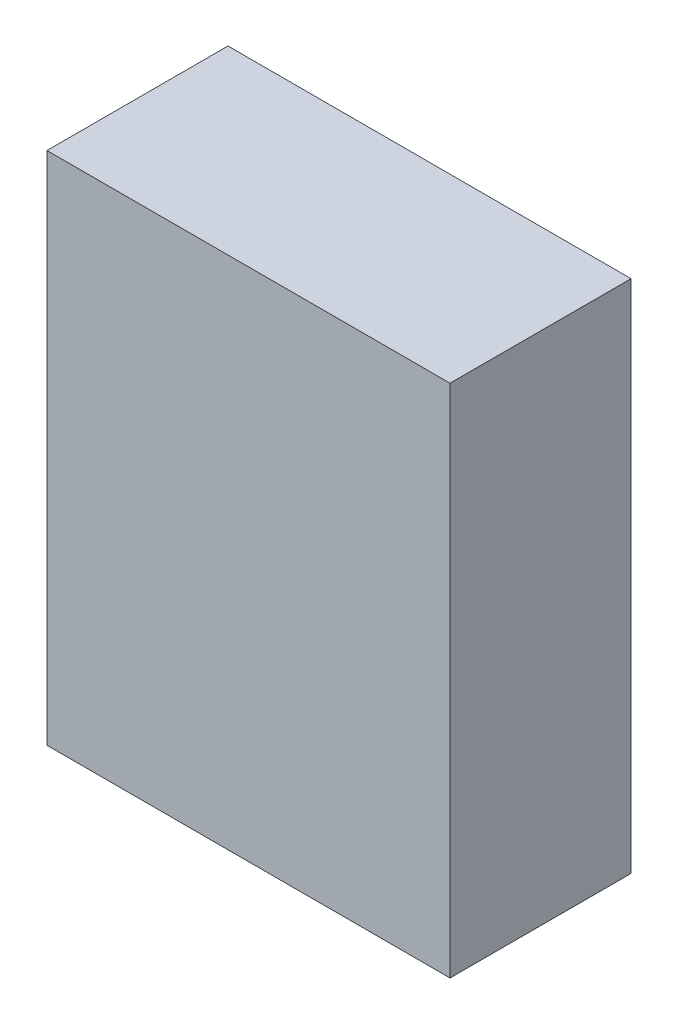
ISO-10303-21;
HEADER;
FILE_DESCRIPTION(('STEP AP214'),'2;1');
FILE_NAME('part.step','',(''),(''),'','','');
FILE_SCHEMA(('AUTOMOTIVE_DESIGN { 1 0 10303 214 1 1 1 1 }'));
ENDSEC;
DATA;
#1=APPLICATION_CONTEXT('core data for automotive mechanical design processes');
#2=APPLICATION_PROTOCOL_DEFINITION('international standard','automotive_design',2000,#1);
#3=PRODUCT_CONTEXT('',#1,'mechanical');
#4=PRODUCT('Part','Part','',(#3));
#5=PRODUCT_RELATED_PRODUCT_CATEGORY('part','',(#4));
#6=PRODUCT_DEFINITION_FORMATION('','',#4);
#7=PRODUCT_DEFINITION_CONTEXT('part definition',#1,'design');
#8=PRODUCT_DEFINITION('design','',#6,#7);
#9=PRODUCT_DEFINITION_SHAPE('','',#8);
#10=(LENGTH_UNIT() NAMED_UNIT(*) SI_UNIT(.MILLI.,.METRE.));
#11=(NAMED_UNIT(*) PLANE_ANGLE_UNIT() SI_UNIT($,.RADIAN.));
#12=(NAMED_UNIT(*) SI_UNIT($,.STERADIAN.) SOLID_ANGLE_UNIT());
#13=UNCERTAINTY_MEASURE_WITH_UNIT(LENGTH_MEASURE(1.E-05),#10,'distance_accuracy_value','');
#14=(GEOMETRIC_REPRESENTATION_CONTEXT(3) GLOBAL_UNCERTAINTY_ASSIGNED_CONTEXT((#13)) GLOBAL_UNIT_ASSIGNED_CONTEXT((#10,
#11,#12)) REPRESENTATION_CONTEXT('',''));
#15=CARTESIAN_POINT('',(0.,0.,0.));
#16=DIRECTION('',(0.,0.,1.));
#17=DIRECTION('',(1.,0.,0.));
#18=AXIS2_PLACEMENT_3D('',#15,#16,#17);
#19=CARTESIAN_POINT('',(28.956,37.0078,13.0048));
#20=DIRECTION('',(1.,0.,0.));
#21=DIRECTION('',(0.,1.,0.));
#22=AXIS2_PLACEMENT_3D('',#19,#20,#21);
#23=PLANE('',#22);
#24=DIRECTION('',(0.,-1.,0.));
#25=VECTOR('',#24,1.);
#26=CARTESIAN_POINT('',(28.956,37.0078,0.));
#27=LINE('',#26,#25);
#28=CARTESIAN_POINT('',(28.956,37.0078,0.));
#29=VERTEX_POINT('',#28);
#30=CARTESIAN_POINT('',(28.956,0.,0.));
#31=VERTEX_POINT('',#30);
#32=EDGE_CURVE('E67',#29,#31,#27,.T.);
#33=ORIENTED_EDGE('',*,*,#32,.F.);
#34=DIRECTION('',(0.,0.,-1.));
#35=VECTOR('',#34,1.);
#36=CARTESIAN_POINT('',(28.956,37.0078,13.0048));
#37=LINE('',#36,#35);
#38=CARTESIAN_POINT('',(28.956,37.0078,13.0048));
#39=VERTEX_POINT('',#38);
#40=EDGE_CURVE('E19',#39,#29,#37,.T.);
#41=ORIENTED_EDGE('',*,*,#40,.F.);
#42=DIRECTION('',(0.,-1.,0.));
#43=VECTOR('',#42,1.);
#44=CARTESIAN_POINT('',(28.956,37.0078,13.0048));
#45=LINE('',#44,#43);
#46=CARTESIAN_POINT('',(28.956,0.,13.0048));
#47=VERTEX_POINT('',#46);
#48=EDGE_CURVE('E69',#39,#47,#45,.T.);
#49=ORIENTED_EDGE('',*,*,#48,.T.);
#50=DIRECTION('',(0.,0.,-1.));
#51=VECTOR('',#50,1.);
#52=CARTESIAN_POINT('',(28.956,0.,13.0048));
#53=LINE('',#52,#51);
#54=EDGE_CURVE('E11',#47,#31,#53,.T.);
#55=ORIENTED_EDGE('',*,*,#54,.T.);
#56=EDGE_LOOP('',(#33,#41,#49,#55));
#57=FACE_BOUND('',#56,.T.);
#58=ADVANCED_FACE('F16',(#57),#23,.T.);
#59=CARTESIAN_POINT('',(28.956,0.,13.0048));
#60=DIRECTION('',(0.,-1.,0.));
#61=DIRECTION('',(0.,0.,-1.));
#62=AXIS2_PLACEMENT_3D('',#59,#60,#61);
#63=PLANE('',#62);
#64=DIRECTION('',(-1.,0.,0.));
#65=VECTOR('',#64,1.);
#66=CARTESIAN_POINT('',(28.956,0.,0.));
#67=LINE('',#66,#65);
#68=CARTESIAN_POINT('',(0.,0.,0.));
#69=VERTEX_POINT('',#68);
#70=EDGE_CURVE('E72',#31,#69,#67,.T.);
#71=ORIENTED_EDGE('',*,*,#70,.F.);
#72=ORIENTED_EDGE('',*,*,#54,.F.);
#73=DIRECTION('',(-1.,0.,0.));
#74=VECTOR('',#73,1.);
#75=CARTESIAN_POINT('',(28.956,0.,13.0048));
#76=LINE('',#75,#74);
#77=CARTESIAN_POINT('',(0.,0.,13.0048));
#78=VERTEX_POINT('',#77);
#79=EDGE_CURVE('E78',#47,#78,#76,.T.);
#80=ORIENTED_EDGE('',*,*,#79,.T.);
#81=DIRECTION('',(0.,0.,-1.));
#82=VECTOR('',#81,1.);
#83=CARTESIAN_POINT('',(0.,0.,13.0048));
#84=LINE('',#83,#82);
#85=EDGE_CURVE('E24',#78,#69,#84,.T.);
#86=ORIENTED_EDGE('',*,*,#85,.T.);
#87=EDGE_LOOP('',(#71,#72,#80,#86));
#88=FACE_BOUND('',#87,.T.);
#89=ADVANCED_FACE('F85',(#88),#63,.T.);
#90=CARTESIAN_POINT('',(0.,0.,13.0048));
#91=DIRECTION('',(-1.,0.,0.));
#92=DIRECTION('',(0.,-1.,0.));
#93=AXIS2_PLACEMENT_3D('',#90,#91,#92);
#94=PLANE('',#93);
#95=DIRECTION('',(0.,1.,0.));
#96=VECTOR('',#95,1.);
#97=CARTESIAN_POINT('',(0.,0.,0.));
#98=LINE('',#97,#96);
#99=CARTESIAN_POINT('',(0.,37.0078,0.));
#100=VERTEX_POINT('',#99);
#101=EDGE_CURVE('E68',#69,#100,#98,.T.);
#102=ORIENTED_EDGE('',*,*,#101,.F.);
#103=ORIENTED_EDGE('',*,*,#85,.F.);
#104=DIRECTION('',(0.,1.,0.));
#105=VECTOR('',#104,1.);
#106=CARTESIAN_POINT('',(0.,0.,13.0048));
#107=LINE('',#106,#105);
#108=CARTESIAN_POINT('',(0.,37.0078,13.0048));
#109=VERTEX_POINT('',#108);
#110=EDGE_CURVE('E80',#78,#109,#107,.T.);
#111=ORIENTED_EDGE('',*,*,#110,.T.);
#112=DIRECTION('',(0.,0.,-1.));
#113=VECTOR('',#112,1.);
#114=CARTESIAN_POINT('',(0.,37.0078,13.0048));
#115=LINE('',#114,#113);
#116=EDGE_CURVE('E31',#109,#100,#115,.T.);
#117=ORIENTED_EDGE('',*,*,#116,.T.);
#118=EDGE_LOOP('',(#102,#103,#111,#117));
#119=FACE_BOUND('',#118,.T.);
#120=ADVANCED_FACE('F88',(#119),#94,.T.);
#121=CARTESIAN_POINT('',(0.,37.0078,13.0048));
#122=DIRECTION('',(0.,1.,0.));
#123=DIRECTION('',(0.,0.,1.));
#124=AXIS2_PLACEMENT_3D('',#121,#122,#123);
#125=PLANE('',#124);
#126=DIRECTION('',(1.,0.,0.));
#127=VECTOR('',#126,1.);
#128=CARTESIAN_POINT('',(0.,37.0078,0.));
#129=LINE('',#128,#127);
#130=EDGE_CURVE('E55',#100,#29,#129,.T.);
#131=ORIENTED_EDGE('',*,*,#130,.F.);
#132=ORIENTED_EDGE('',*,*,#116,.F.);
#133=DIRECTION('',(1.,0.,0.));
#134=VECTOR('',#133,1.);
#135=CARTESIAN_POINT('',(0.,37.0078,13.0048));
#136=LINE('',#135,#134);
#137=EDGE_CURVE('E58',#109,#39,#136,.T.);
#138=ORIENTED_EDGE('',*,*,#137,.T.);
#139=ORIENTED_EDGE('',*,*,#40,.T.);
#140=EDGE_LOOP('',(#131,#132,#138,#139));
#141=FACE_BOUND('',#140,.T.);
#142=ADVANCED_FACE('F54',(#141),#125,.T.);
#143=CARTESIAN_POINT('',(28.956,0.,13.0048));
#144=DIRECTION('',(0.,0.,-1.));
#145=DIRECTION('',(-1.,0.,0.));
#146=AXIS2_PLACEMENT_3D('',#143,#144,#145);
#147=PLANE('',#146);
#148=ORIENTED_EDGE('',*,*,#48,.F.);
#149=ORIENTED_EDGE('',*,*,#137,.F.);
#150=ORIENTED_EDGE('',*,*,#110,.F.);
#151=ORIENTED_EDGE('',*,*,#79,.F.);
#152=EDGE_LOOP('',(#148,#149,#150,#151));
#153=FACE_BOUND('',#152,.T.);
#154=ADVANCED_FACE('F90',(#153),#147,.F.);
#155=CARTESIAN_POINT('',(28.956,0.,0.));
#156=DIRECTION('',(0.,0.,-1.));
#157=DIRECTION('',(-1.,0.,0.));
#158=AXIS2_PLACEMENT_3D('',#155,#156,#157);
#159=PLANE('',#158);
#160=ORIENTED_EDGE('',*,*,#32,.T.);
#161=ORIENTED_EDGE('',*,*,#70,.T.);
#162=ORIENTED_EDGE('',*,*,#101,.T.);
#163=ORIENTED_EDGE('',*,*,#130,.T.);
#164=EDGE_LOOP('',(#160,#161,#162,#163));
#165=FACE_BOUND('',#164,.T.);
#166=ADVANCED_FACE('F65',(#165),#159,.T.);
#167=CLOSED_SHELL('',(#58,#89,#120,#142,#154,#166));
#168=MANIFOLD_SOLID_BREP('B1',#167);
#169=ADVANCED_BREP_SHAPE_REPRESENTATION('',(#18,#168),#14);
#170=SHAPE_DEFINITION_REPRESENTATION(#9,#169);
ENDSEC;
END-ISO-10303-21;
